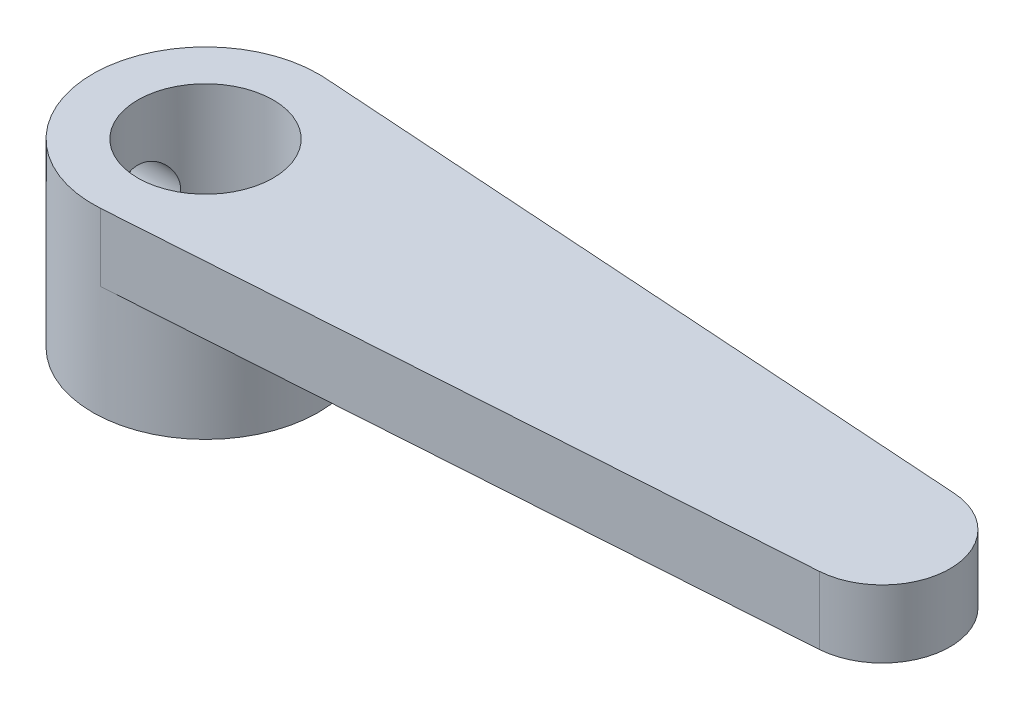
ISO-10303-21;
HEADER;
FILE_DESCRIPTION(('STEP AP214'),'2;1');
FILE_NAME('part.step','',(''),(''),'','','');
FILE_SCHEMA(('AUTOMOTIVE_DESIGN { 1 0 10303 214 1 1 1 1 }'));
ENDSEC;
DATA;
#1=APPLICATION_CONTEXT('core data for automotive mechanical design processes');
#2=APPLICATION_PROTOCOL_DEFINITION('international standard','automotive_design',2000,#1);
#3=PRODUCT_CONTEXT('',#1,'mechanical');
#4=PRODUCT('Part','Part','',(#3));
#5=PRODUCT_RELATED_PRODUCT_CATEGORY('part','',(#4));
#6=PRODUCT_DEFINITION_FORMATION('','',#4);
#7=PRODUCT_DEFINITION_CONTEXT('part definition',#1,'design');
#8=PRODUCT_DEFINITION('design','',#6,#7);
#9=PRODUCT_DEFINITION_SHAPE('','',#8);
#10=(LENGTH_UNIT() NAMED_UNIT(*) SI_UNIT(.MILLI.,.METRE.));
#11=(NAMED_UNIT(*) PLANE_ANGLE_UNIT() SI_UNIT($,.RADIAN.));
#12=(NAMED_UNIT(*) SI_UNIT($,.STERADIAN.) SOLID_ANGLE_UNIT());
#13=UNCERTAINTY_MEASURE_WITH_UNIT(LENGTH_MEASURE(1.E-05),#10,'distance_accuracy_value','');
#14=(GEOMETRIC_REPRESENTATION_CONTEXT(3) GLOBAL_UNCERTAINTY_ASSIGNED_CONTEXT((#13)) GLOBAL_UNIT_ASSIGNED_CONTEXT((#10,
#11,#12)) REPRESENTATION_CONTEXT('',''));
#15=CARTESIAN_POINT('',(0.,0.,0.));
#16=DIRECTION('',(0.,0.,1.));
#17=DIRECTION('',(1.,0.,0.));
#18=AXIS2_PLACEMENT_3D('',#15,#16,#17);
#19=CARTESIAN_POINT('',(0.,0.,0.));
#20=DIRECTION('',(0.,1.,0.));
#21=DIRECTION('',(0.,0.,1.));
#22=AXIS2_PLACEMENT_3D('',#19,#20,#21);
#23=PLANE('',#22);
#24=CARTESIAN_POINT('',(0.,0.,0.));
#25=DIRECTION('',(0.,-1.,0.));
#26=DIRECTION('',(0.,0.,-1.));
#27=AXIS2_PLACEMENT_3D('',#24,#25,#26);
#28=CIRCLE('',#27,5.);
#29=CARTESIAN_POINT('',(0.333333333333334,0.,-4.98887651569859));
#30=VERTEX_POINT('',#29);
#31=CARTESIAN_POINT('',(0.333333333333333,0.,4.98887651569859));
#32=VERTEX_POINT('',#31);
#33=EDGE_CURVE('E88',#30,#32,#28,.T.);
#34=ORIENTED_EDGE('',*,*,#33,.F.);
#35=DIRECTION('',(-0.997775303139718,0.,-0.0666666666666667));
#36=VECTOR('',#35,1.);
#37=CARTESIAN_POINT('',(0.333333333333333,0.,-4.98887651569859));
#38=LINE('',#37,#36);
#39=CARTESIAN_POINT('',(30.2,0.,-2.99332590941915));
#40=VERTEX_POINT('',#39);
#41=EDGE_CURVE('E90',#40,#30,#38,.T.);
#42=ORIENTED_EDGE('',*,*,#41,.F.);
#43=CARTESIAN_POINT('',(30.,0.,0.));
#44=DIRECTION('',(0.,1.,0.));
#45=DIRECTION('',(0.,0.,-1.));
#46=AXIS2_PLACEMENT_3D('',#43,#44,#45);
#47=CIRCLE('',#46,3.);
#48=CARTESIAN_POINT('',(30.2,0.,2.99332590941915));
#49=VERTEX_POINT('',#48);
#50=EDGE_CURVE('E78',#49,#40,#47,.T.);
#51=ORIENTED_EDGE('',*,*,#50,.F.);
#52=DIRECTION('',(0.997775303139718,0.,-0.0666666666666667));
#53=VECTOR('',#52,1.);
#54=CARTESIAN_POINT('',(0.333333333333333,0.,4.98887651569859));
#55=LINE('',#54,#53);
#56=EDGE_CURVE('E71',#32,#49,#55,.T.);
#57=ORIENTED_EDGE('',*,*,#56,.F.);
#58=EDGE_LOOP('',(#34,#42,#51,#57));
#59=FACE_BOUND('',#58,.T.);
#60=ADVANCED_FACE('F33',(#59),#23,.F.);
#61=CARTESIAN_POINT('',(0.,3.,0.));
#62=DIRECTION('',(0.,1.,0.));
#63=DIRECTION('',(0.,0.,1.));
#64=AXIS2_PLACEMENT_3D('',#61,#62,#63);
#65=PLANE('',#64);
#66=CARTESIAN_POINT('',(0.,3.,0.));
#67=DIRECTION('',(0.,1.,0.));
#68=DIRECTION('',(0.,0.,1.));
#69=AXIS2_PLACEMENT_3D('',#66,#67,#68);
#70=CIRCLE('',#69,5.);
#71=CARTESIAN_POINT('',(0.333333333333333,3.,-4.98887651569859));
#72=VERTEX_POINT('',#71);
#73=CARTESIAN_POINT('',(0.333333333333333,3.,4.98887651569859));
#74=VERTEX_POINT('',#73);
#75=EDGE_CURVE('E102',#72,#74,#70,.T.);
#76=ORIENTED_EDGE('',*,*,#75,.T.);
#77=DIRECTION('',(0.997775303139718,0.,-0.0666666666666667));
#78=VECTOR('',#77,1.);
#79=CARTESIAN_POINT('',(0.333333333333333,3.,4.98887651569859));
#80=LINE('',#79,#78);
#81=CARTESIAN_POINT('',(30.2,3.,2.99332590941915));
#82=VERTEX_POINT('',#81);
#83=EDGE_CURVE('E83',#74,#82,#80,.T.);
#84=ORIENTED_EDGE('',*,*,#83,.T.);
#85=CARTESIAN_POINT('',(30.,3.,0.));
#86=DIRECTION('',(0.,1.,0.));
#87=DIRECTION('',(0.,0.,-1.));
#88=AXIS2_PLACEMENT_3D('',#85,#86,#87);
#89=CIRCLE('',#88,3.);
#90=CARTESIAN_POINT('',(30.2,3.,-2.99332590941915));
#91=VERTEX_POINT('',#90);
#92=EDGE_CURVE('E107',#82,#91,#89,.T.);
#93=ORIENTED_EDGE('',*,*,#92,.T.);
#94=DIRECTION('',(-0.997775303139718,0.,-0.0666666666666667));
#95=VECTOR('',#94,1.);
#96=CARTESIAN_POINT('',(0.333333333333333,3.,-4.98887651569859));
#97=LINE('',#96,#95);
#98=EDGE_CURVE('E57',#91,#72,#97,.T.);
#99=ORIENTED_EDGE('',*,*,#98,.T.);
#100=EDGE_LOOP('',(#76,#84,#93,#99));
#101=FACE_BOUND('',#100,.T.);
#102=CARTESIAN_POINT('',(0.,3.,0.));
#103=DIRECTION('',(0.,1.,0.));
#104=DIRECTION('',(0.,0.,1.));
#105=AXIS2_PLACEMENT_3D('',#102,#103,#104);
#106=CIRCLE('',#105,3.);
#107=CARTESIAN_POINT('',(0.,3.,3.));
#108=VERTEX_POINT('',#107);
#109=EDGE_CURVE('E113',#108,#108,#106,.T.);
#110=ORIENTED_EDGE('',*,*,#109,.F.);
#111=EDGE_LOOP('',(#110));
#112=FACE_BOUND('',#111,.T.);
#113=ADVANCED_FACE('F144',(#101,#112),#65,.T.);
#114=CARTESIAN_POINT('',(0.,3.,0.));
#115=DIRECTION('',(0.,-1.,0.));
#116=DIRECTION('',(0.,0.,-1.));
#117=AXIS2_PLACEMENT_3D('',#114,#115,#116);
#118=CYLINDRICAL_SURFACE('',#117,5.);
#119=CARTESIAN_POINT('',(-5.,-2.5,0.));
#120=CARTESIAN_POINT('',(-4.9999992925055,-2.49999900251511,-0.0822886127533));
#121=CARTESIAN_POINT('',(-4.99794915693954,-2.49320613637603,-0.164587318351529));
#122=CARTESIAN_POINT('',(-4.98997105593691,-2.4662786457779,-0.326788125304881));
#123=CARTESIAN_POINT('',(-4.98404193389692,-2.44614004197666,-0.40668950441142));
#124=CARTESIAN_POINT('',(-4.96895552501837,-2.39325398308974,-0.561732707754527));
#125=CARTESIAN_POINT('',(-4.95980300250426,-2.36052513038106,-0.636881364395373));
#126=CARTESIAN_POINT('',(-4.93922109237646,-2.28346390694416,-0.780624181053131));
#127=CARTESIAN_POINT('',(-4.92779140192067,-2.23912999260458,-0.84921746746967));
#128=CARTESIAN_POINT('',(-4.90350737192774,-2.13877599252733,-0.979871797183745));
#129=CARTESIAN_POINT('',(-4.89062383657036,-2.08248337411409,-1.04171807124434));
#130=CARTESIAN_POINT('',(-4.86505834210442,-1.96039077008982,-1.15524920923324));
#131=CARTESIAN_POINT('',(-4.85237641724502,-1.89458918787504,-1.20693236327441));
#132=CARTESIAN_POINT('',(-4.82834113993772,-1.75352924696239,-1.29980037723708));
#133=CARTESIAN_POINT('',(-4.81702406663875,-1.67809153900926,-1.34072309022213));
#134=CARTESIAN_POINT('',(-4.79743620394031,-1.52101074576971,-1.4092139477476));
#135=CARTESIAN_POINT('',(-4.78916468313311,-1.43936915607202,-1.43678529919973));
#136=CARTESIAN_POINT('',(-4.77690870838434,-1.27460973386954,-1.47701633682652));
#137=CARTESIAN_POINT('',(-4.77281069324534,-1.19159725613606,-1.49007196234677));
#138=CARTESIAN_POINT('',(-4.76902789749768,-1.02446684378323,-1.50213730614672));
#139=CARTESIAN_POINT('',(-4.76934204760571,-0.940349181940912,-1.50115042761078));
#140=CARTESIAN_POINT('',(-4.77424744067778,-0.776616091391516,-1.48546977199812));
#141=CARTESIAN_POINT('',(-4.77868388599141,-0.696947749637761,-1.47127205262685));
#142=CARTESIAN_POINT('',(-4.79108356228624,-0.541180213726539,-1.43037420427056));
#143=CARTESIAN_POINT('',(-4.79904714132351,-0.465081372625666,-1.40367284141641));
#144=CARTESIAN_POINT('',(-4.81772733074973,-0.31739965033926,-1.33816026653682));
#145=CARTESIAN_POINT('',(-4.82848016115952,-0.245892916044737,-1.29918816934642));
#146=CARTESIAN_POINT('',(-4.85150987000065,-0.110267977989807,-1.21035222588683));
#147=CARTESIAN_POINT('',(-4.86378711746991,-0.0461515705862217,-1.16048574002588));
#148=CARTESIAN_POINT('',(-4.88911011297938,0.0756861907620217,-1.04881290765546));
#149=CARTESIAN_POINT('',(-4.90216654310498,0.133028664029671,-0.986594907466971));
#150=CARTESIAN_POINT('',(-4.92712244063259,0.236553984064249,-0.853263259313966));
#151=CARTESIAN_POINT('',(-4.9390218351841,0.282736128414427,-0.782149051860887));
#152=CARTESIAN_POINT('',(-4.96043160069471,0.362859922464731,-0.632355038342802));
#153=CARTESIAN_POINT('',(-4.96992543668314,0.396717516249861,-0.55362774974795));
#154=CARTESIAN_POINT('',(-4.98533521832222,0.450599590099631,-0.391245415603519));
#155=CARTESIAN_POINT('',(-4.99125216187,0.47062792853249,-0.307591751589581));
#156=CARTESIAN_POINT('',(-4.99868364643539,0.495652177899394,-0.140952242668331));
#157=CARTESIAN_POINT('',(-5.0003485041779,0.501161585801611,-0.0580500976011861));
#158=CARTESIAN_POINT('',(-4.9995292324176,0.498430844287919,0.107499605823384));
#159=CARTESIAN_POINT('',(-4.99704565677757,0.490192530348558,0.190147196690782));
#160=CARTESIAN_POINT('',(-4.98830696987163,0.460615388888504,0.350903605309698));
#161=CARTESIAN_POINT('',(-4.98213829799417,0.43957661241913,0.42907277261417));
#162=CARTESIAN_POINT('',(-4.96674347841533,0.385356767221799,0.580754638954522));
#163=CARTESIAN_POINT('',(-4.95751696321085,0.352174238962138,0.654266777025584));
#164=CARTESIAN_POINT('',(-4.93669654351325,0.273746834518868,0.796437189461053));
#165=CARTESIAN_POINT('',(-4.92505280829675,0.228240659052027,0.86494382619967));
#166=CARTESIAN_POINT('',(-4.90073468764318,0.126775245947188,0.993523307980147));
#167=CARTESIAN_POINT('',(-4.8880600443108,0.0708133881123275,1.05359403235594));
#168=CARTESIAN_POINT('',(-4.86253171869138,-0.0523873083693465,1.16585744551027));
#169=CARTESIAN_POINT('',(-4.84968825033268,-0.119961875771737,1.21768481231504));
#170=CARTESIAN_POINT('',(-4.82576515238464,-0.263127939013533,1.30928995072154));
#171=CARTESIAN_POINT('',(-4.81468547654652,-0.338719224558215,1.34906803829472));
#172=CARTESIAN_POINT('',(-4.79567189615055,-0.495532491254689,1.41517347127168));
#173=CARTESIAN_POINT('',(-4.78772337843827,-0.576726186536592,1.4415634693705));
#174=CARTESIAN_POINT('',(-4.77591594362794,-0.742687968931479,1.48021730815114));
#175=CARTESIAN_POINT('',(-4.77205562508301,-0.82745482078767,1.49248598978779));
#176=CARTESIAN_POINT('',(-4.76899972496087,-0.994361518376229,1.50221984485059));
#177=CARTESIAN_POINT('',(-4.76961647442755,-1.07646365101759,1.5002805530849));
#178=CARTESIAN_POINT('',(-4.77499401288294,-1.2391141033728,1.48307505444813));
#179=CARTESIAN_POINT('',(-4.77975463592551,-1.31966248517635,1.46780938124716));
#180=CARTESIAN_POINT('',(-4.79275763670386,-1.47594539914285,1.42476888804136));
#181=CARTESIAN_POINT('',(-4.80095604545965,-1.55172728736169,1.39715175507068));
#182=CARTESIAN_POINT('',(-4.81990278909137,-1.69764243881772,1.33031507121129));
#183=CARTESIAN_POINT('',(-4.83065161194312,-1.76777461764076,1.29109329962876));
#184=CARTESIAN_POINT('',(-4.85397676425833,-1.90316311652711,1.20048763805072));
#185=CARTESIAN_POINT('',(-4.86660540163798,-1.96814876126041,1.14871276092994));
#186=CARTESIAN_POINT('',(-4.89201320450026,-2.08870249830786,1.03517434629782));
#187=CARTESIAN_POINT('',(-4.90479240823905,-2.14426813946776,0.973408217134501));
#188=CARTESIAN_POINT('',(-4.92950936570649,-2.24602341229503,0.839465762183247));
#189=CARTESIAN_POINT('',(-4.94141159765674,-2.29189144685549,0.767037885790607));
#190=CARTESIAN_POINT('',(-4.96260680455813,-2.37073516990403,0.615141373983529));
#191=CARTESIAN_POINT('',(-4.97190099931067,-2.40371688827451,0.535676052998954));
#192=CARTESIAN_POINT('',(-4.98602174969301,-2.45289527565275,0.380757712655281));
#193=CARTESIAN_POINT('',(-4.99122027381068,-2.47051167288325,0.305786961954234));
#194=CARTESIAN_POINT('',(-4.99820944494493,-2.49406352524158,0.15388019523078));
#195=CARTESIAN_POINT('',(-5.0000006615474,-2.50000093270482,0.0769445098581396));
#196=CARTESIAN_POINT('',(-5.,-2.5,0.));
#197=B_SPLINE_CURVE_WITH_KNOTS('',3,(#119,#120,#121,#122,#123,#124,#125,#126,#127,#128,#129,
#130,#131,#132,#133,#134,#135,#136,#137,#138,#139,#140,#141,#142,#143,#144,#145,#146,#147,#148,
#149,#150,#151,#152,#153,#154,#155,#156,#157,#158,#159,#160,#161,#162,#163,#164,#165,#166,#167,
#168,#169,#170,#171,#172,#173,#174,#175,#176,#177,#178,#179,#180,#181,#182,#183,#184,#185,#186,
#187,#188,#189,#190,#191,#192,#193,#194,#195,#196),.UNSPECIFIED.,.T.,.F.,(4,2,2,2,2,2,2,2,2,2,2,
2,2,2,2,2,2,2,2,2,2,2,2,2,2,2,2,2,2,2,2,2,2,2,2,2,2,2,4),(0.,0.246583203612611,0.493239964846,
0.739533676300875,0.985860164412702,1.23855602948191,1.49129437288633,1.74971481004109,
2.00807314543224,2.25919689356599,2.51025978319089,2.75226016697676,2.99428443658001,
3.2396242644712,3.48502360158555,3.74067104048167,3.99633456531071,4.25371046881689,
4.51101453528808,4.75908809438545,5.00712853550327,5.24956746682327,5.49203554593729,
5.74011305702908,5.98825282000191,6.24540400322818,6.5025484425268,6.75847814951252,
7.01432009460283,7.25950155466943,7.504673196616,7.74680040402721,7.98897397553107,
8.23996925679931,8.49102974897502,8.74942996156671,9.00770911595235,9.23831691930459,
9.46888616948874),.UNSPECIFIED.);
#198=CARTESIAN_POINT('',(-5.,-2.5,0.));
#199=VERTEX_POINT('',#198);
#200=EDGE_CURVE('E125',#199,#199,#197,.T.);
#201=ORIENTED_EDGE('',*,*,#200,.T.);
#202=EDGE_LOOP('',(#201));
#203=FACE_BOUND('',#202,.T.);
#204=DIRECTION('',(0.,-1.,0.));
#205=VECTOR('',#204,1.);
#206=CARTESIAN_POINT('',(0.333333333333333,3.,-4.98887651569859));
#207=LINE('',#206,#205);
#208=EDGE_CURVE('E99',#72,#30,#207,.T.);
#209=ORIENTED_EDGE('',*,*,#208,.T.);
#210=ORIENTED_EDGE('',*,*,#33,.T.);
#211=DIRECTION('',(0.,-1.,0.));
#212=VECTOR('',#211,1.);
#213=CARTESIAN_POINT('',(0.333333333333333,3.,4.98887651569859));
#214=LINE('',#213,#212);
#215=EDGE_CURVE('E11',#74,#32,#214,.T.);
#216=ORIENTED_EDGE('',*,*,#215,.F.);
#217=ORIENTED_EDGE('',*,*,#75,.F.);
#218=EDGE_LOOP('',(#209,#210,#216,#217));
#219=FACE_BOUND('',#218,.T.);
#220=CARTESIAN_POINT('',(0.,-5.,0.));
#221=DIRECTION('',(0.,-1.,0.));
#222=DIRECTION('',(0.,0.,-1.));
#223=AXIS2_PLACEMENT_3D('',#220,#221,#222);
#224=CIRCLE('',#223,5.);
#225=CARTESIAN_POINT('',(0.,-5.,-5.));
#226=VERTEX_POINT('',#225);
#227=EDGE_CURVE('E94',#226,#226,#224,.T.);
#228=ORIENTED_EDGE('',*,*,#227,.F.);
#229=EDGE_LOOP('',(#228));
#230=FACE_BOUND('',#229,.T.);
#231=ADVANCED_FACE('F35',(#203,#219,#230),#118,.T.);
#232=CARTESIAN_POINT('',(0.333333333333333,3.,4.98887651569859));
#233=DIRECTION('',(-0.0666666666666667,0.,-0.997775303139718));
#234=DIRECTION('',(-0.997775303139718,0.,0.0666666666666667));
#235=AXIS2_PLACEMENT_3D('',#232,#233,#234);
#236=PLANE('',#235);
#237=ORIENTED_EDGE('',*,*,#56,.T.);
#238=DIRECTION('',(0.,-1.,0.));
#239=VECTOR('',#238,1.);
#240=CARTESIAN_POINT('',(30.2,3.,2.99332590941915));
#241=LINE('',#240,#239);
#242=EDGE_CURVE('E49',#82,#49,#241,.T.);
#243=ORIENTED_EDGE('',*,*,#242,.F.);
#244=ORIENTED_EDGE('',*,*,#83,.F.);
#245=ORIENTED_EDGE('',*,*,#215,.T.);
#246=EDGE_LOOP('',(#237,#243,#244,#245));
#247=FACE_BOUND('',#246,.T.);
#248=ADVANCED_FACE('F152',(#247),#236,.F.);
#249=CARTESIAN_POINT('',(30.,3.,0.));
#250=DIRECTION('',(0.,-1.,0.));
#251=DIRECTION('',(0.,0.,-1.));
#252=AXIS2_PLACEMENT_3D('',#249,#250,#251);
#253=CYLINDRICAL_SURFACE('',#252,3.);
#254=ORIENTED_EDGE('',*,*,#50,.T.);
#255=DIRECTION('',(0.,-1.,0.));
#256=VECTOR('',#255,1.);
#257=CARTESIAN_POINT('',(30.2,3.,-2.99332590941915));
#258=LINE('',#257,#256);
#259=EDGE_CURVE('E101',#91,#40,#258,.T.);
#260=ORIENTED_EDGE('',*,*,#259,.F.);
#261=ORIENTED_EDGE('',*,*,#92,.F.);
#262=ORIENTED_EDGE('',*,*,#242,.T.);
#263=EDGE_LOOP('',(#254,#260,#261,#262));
#264=FACE_BOUND('',#263,.T.);
#265=ADVANCED_FACE('F112',(#264),#253,.T.);
#266=CARTESIAN_POINT('',(0.333333333333333,3.,-4.98887651569859));
#267=DIRECTION('',(-0.0666666666666667,0.,0.997775303139718));
#268=DIRECTION('',(0.997775303139718,0.,0.0666666666666667));
#269=AXIS2_PLACEMENT_3D('',#266,#267,#268);
#270=PLANE('',#269);
#271=ORIENTED_EDGE('',*,*,#41,.T.);
#272=ORIENTED_EDGE('',*,*,#208,.F.);
#273=ORIENTED_EDGE('',*,*,#98,.F.);
#274=ORIENTED_EDGE('',*,*,#259,.T.);
#275=EDGE_LOOP('',(#271,#272,#273,#274));
#276=FACE_BOUND('',#275,.T.);
#277=ADVANCED_FACE('F98',(#276),#270,.F.);
#278=CARTESIAN_POINT('',(0.,3.,0.));
#279=DIRECTION('',(0.,-1.,0.));
#280=DIRECTION('',(0.,0.,-1.));
#281=AXIS2_PLACEMENT_3D('',#278,#279,#280);
#282=CYLINDRICAL_SURFACE('',#281,3.);
#283=CARTESIAN_POINT('',(-2.59807621135332,-1.,-1.5));
#284=CARTESIAN_POINT('',(-2.59808302092689,-0.921838287707125,-1.4999945446118));
#285=CARTESIAN_POINT('',(-2.60165701781635,-0.843577882712432,-1.49384995609983));
#286=CARTESIAN_POINT('',(-2.61543549678079,-0.689459102984271,-1.46958481484708));
#287=CARTESIAN_POINT('',(-2.62565391083339,-0.613606127434888,-1.45143909683127));
#288=CARTESIAN_POINT('',(-2.65124019908098,-0.466822503484089,-1.40414992304972));
#289=CARTESIAN_POINT('',(-2.66658065209878,-0.39586802128962,-1.3750649287406));
#290=CARTESIAN_POINT('',(-2.70063997225287,-0.259863697004921,-1.30690128806456));
#291=CARTESIAN_POINT('',(-2.71935902214097,-0.194814174606314,-1.26782210105366));
#292=CARTESIAN_POINT('',(-2.75995303586162,-0.0665414071637416,-1.17699981079632));
#293=CARTESIAN_POINT('',(-2.7819609545693,-0.00391129648968492,-1.12447805421566));
#294=CARTESIAN_POINT('',(-2.82557974178559,0.112112582610064,-1.0098807114217));
#295=CARTESIAN_POINT('',(-2.84719040746875,0.165501743875281,-0.94780038867344));
#296=CARTESIAN_POINT('',(-2.88932215429424,0.265050726721494,-0.810734345121819));
#297=CARTESIAN_POINT('',(-2.90967159627259,0.310480651789295,-0.735160783518862));
#298=CARTESIAN_POINT('',(-2.94526134149294,0.387711279868644,-0.576235539899256));
#299=CARTESIAN_POINT('',(-2.96050486775612,0.419520584205755,-0.492888807207233));
#300=CARTESIAN_POINT('',(-2.98320691866356,0.466256991951646,-0.327067415888966));
#301=CARTESIAN_POINT('',(-2.99114220331338,0.4822242895333,-0.244952685733226));
#302=CARTESIAN_POINT('',(-3.00011375769101,0.500249178012557,-0.0788559430467722));
#303=CARTESIAN_POINT('',(-3.00115420176885,0.502315185193565,0.00512490876560766));
#304=CARTESIAN_POINT('',(-2.99644472874675,0.492879989044476,0.164748786635625));
#305=CARTESIAN_POINT('',(-2.99127743838241,0.482542976718166,0.240481798765187));
#306=CARTESIAN_POINT('',(-2.97561367889621,0.450678734143014,0.388970657877483));
#307=CARTESIAN_POINT('',(-2.96511681099591,0.429150666535666,0.461726281640888));
#308=CARTESIAN_POINT('',(-2.93957374931482,0.37537615086528,0.60346408735433));
#309=CARTESIAN_POINT('',(-2.92446662293799,0.342985530241899,0.672380135272768));
#310=CARTESIAN_POINT('',(-2.89106468980031,0.26860487569776,0.803965202269993));
#311=CARTESIAN_POINT('',(-2.87276874236226,0.226611405046475,0.866631973257969));
#312=CARTESIAN_POINT('',(-2.83266591598844,0.129656972700477,0.990260491347292));
#313=CARTESIAN_POINT('',(-2.81069063997263,0.0738454575109849,1.05050111254404));
#314=CARTESIAN_POINT('',(-2.76681510880218,-0.046884587395265,1.16115655544667));
#315=CARTESIAN_POINT('',(-2.74491492398443,-0.111810058411094,1.21156381736135));
#316=CARTESIAN_POINT('',(-2.70216234138727,-0.253972288636131,1.30425800196332));
#317=CARTESIAN_POINT('',(-2.68146479986061,-0.331729034581317,1.34582597246708));
#318=CARTESIAN_POINT('',(-2.64563175417864,-0.494406507038497,1.41497866950185));
#319=CARTESIAN_POINT('',(-2.63049045069101,-0.579319649526343,1.44257798731633));
#320=CARTESIAN_POINT('',(-2.60916953725552,-0.746821766924186,1.48077031653756));
#321=CARTESIAN_POINT('',(-2.60237483772745,-0.829061678565328,1.49253768317996));
#322=CARTESIAN_POINT('',(-2.59676879042414,-0.994602012274813,1.50227541991714));
#323=CARTESIAN_POINT('',(-2.59795180333967,-1.07790164367968,1.50025553597254));
#324=CARTESIAN_POINT('',(-2.60751504810877,-1.23348087786809,1.48355406501595));
#325=CARTESIAN_POINT('',(-2.61509381259981,-1.30596917666189,1.4702817250687));
#326=CARTESIAN_POINT('',(-2.63541032327012,-1.44755167940644,1.43354442694866));
#327=CARTESIAN_POINT('',(-2.64814974007551,-1.51664477611991,1.41007616793542));
#328=CARTESIAN_POINT('',(-2.67804333119485,-1.65311699635404,1.35247138290733));
#329=CARTESIAN_POINT('',(-2.69537464864595,-1.72026852528033,1.31789109553909));
#330=CARTESIAN_POINT('',(-2.73234179245875,-1.84820390730849,1.23943059602371));
#331=CARTESIAN_POINT('',(-2.75197880032721,-1.90898446526993,1.19554560649832));
#332=CARTESIAN_POINT('',(-2.79431997684504,-2.03046815128532,1.09325575079828));
#333=CARTESIAN_POINT('',(-2.81709874731434,-2.09019572607649,1.03371790847245));
#334=CARTESIAN_POINT('',(-2.86101352466839,-2.19911835699039,0.905106743097433));
#335=CARTESIAN_POINT('',(-2.88214897511564,-2.24830985534581,0.83603021198302));
#336=CARTESIAN_POINT('',(-2.92112042536435,-2.33586058892515,0.687803043838136));
#337=CARTESIAN_POINT('',(-2.93885462508044,-2.37389967731637,0.60843464636117));
#338=CARTESIAN_POINT('',(-2.96825032438952,-2.43570685578609,0.443283546961623));
#339=CARTESIAN_POINT('',(-2.9799171551456,-2.45948747704946,0.357506552088264));
#340=CARTESIAN_POINT('',(-2.99501262272824,-2.49005284626199,0.190469523495626));
#341=CARTESIAN_POINT('',(-2.99909891862287,-2.49819681381417,0.109517165775685));
#342=CARTESIAN_POINT('',(-3.00063195562697,-2.5012648981816,-0.0526889789268056));
#343=CARTESIAN_POINT('',(-2.99808102100335,-2.49619364278535,-0.13394265044263));
#344=CARTESIAN_POINT('',(-2.98700953256884,-2.47387538980656,-0.288806988475721));
#345=CARTESIAN_POINT('',(-2.97889342001985,-2.45745272611349,-0.362568476716896));
#346=CARTESIAN_POINT('',(-2.95788140495135,-2.41400950104554,-0.506168928275427));
#347=CARTESIAN_POINT('',(-2.94498481699194,-2.38698741985982,-0.576007327433263));
#348=CARTESIAN_POINT('',(-2.9148889612218,-2.32190942175104,-0.713135109367327));
#349=CARTESIAN_POINT('',(-2.89752925798199,-2.28343101518824,-0.78018771405007));
#350=CARTESIAN_POINT('',(-2.86032199712739,-2.19706310371142,-0.907161962721038));
#351=CARTESIAN_POINT('',(-2.84047329837541,-2.14916927632649,-0.967080311122361));
#352=CARTESIAN_POINT('',(-2.79792915339941,-2.03980429146595,-1.08437100623534));
#353=CARTESIAN_POINT('',(-2.77514698517547,-1.97745626878421,-1.14089652680891));
#354=CARTESIAN_POINT('',(-2.73094614244278,-1.84382391830535,-1.24299493109201));
#355=CARTESIAN_POINT('',(-2.70952868642798,-1.77253176869847,-1.28855812501509));
#356=CARTESIAN_POINT('',(-2.66999407957374,-1.62004503012857,-1.36864661967848));
#357=CARTESIAN_POINT('',(-2.65200261384405,-1.5386087033069,-1.40277759894141));
#358=CARTESIAN_POINT('',(-2.62299234492527,-1.37000139349033,-1.45631806425962));
#359=CARTESIAN_POINT('',(-2.61195024221553,-1.28285066663097,-1.47577678676302));
#360=CARTESIAN_POINT('',(-2.60293908902686,-1.16229196652201,-1.49155051179662));
#361=CARTESIAN_POINT('',(-2.60112193507728,-1.12994815840318,-1.49471415744578));
#362=CARTESIAN_POINT('',(-2.59868903831625,-1.06507527897664,-1.49894010763494));
#363=CARTESIAN_POINT('',(-2.59807337587664,-1.03254619542119,-1.50000227159981));
#364=CARTESIAN_POINT('',(-2.59807621135332,-1.,-1.5));
#365=B_SPLINE_CURVE_WITH_KNOTS('',3,(#283,#284,#285,#286,#287,#288,#289,#290,#291,#292,#293,
#294,#295,#296,#297,#298,#299,#300,#301,#302,#303,#304,#305,#306,#307,#308,#309,#310,#311,#312,
#313,#314,#315,#316,#317,#318,#319,#320,#321,#322,#323,#324,#325,#326,#327,#328,#329,#330,#331,
#332,#333,#334,#335,#336,#337,#338,#339,#340,#341,#342,#343,#344,#345,#346,#347,#348,#349,#350,
#351,#352,#353,#354,#355,#356,#357,#358,#359,#360,#361,#362,#363,#364),.UNSPECIFIED.,.T.,.F.,(4,
2,2,2,2,2,2,2,2,2,2,2,2,2,2,2,2,2,2,2,2,2,2,2,2,2,2,2,2,2,2,2,2,2,2,2,2,2,2,2,4),(0.,
0.234348183892073,0.469189339237207,0.702792893878329,0.936409088167724,1.18929346874735,
1.44230356626556,1.71236838358145,1.98226240445837,2.23295227451903,2.4834903552906,
2.71224146226808,2.94100968776183,3.1729430209672,3.40495949025408,3.65890787185336,
3.91305072368878,4.18333262594173,4.45333161317557,4.70193436281318,4.9503613978256,
5.17161275136038,5.39293578654095,5.62450944609132,5.85620229330071,6.1171011537092,
6.37808797467303,6.64596272119449,6.91360169713157,7.1566840558423,7.39968130190958,
7.62666637307239,7.8536840026802,8.09041126079208,8.32724745151079,8.58765362775101,
8.84828914267732,9.11716123557908,9.38512699504141,9.48270202777964,9.58028358741811),.UNSPECIFIED.);
#366=CARTESIAN_POINT('',(-2.59807621135332,-1.,-1.5));
#367=VERTEX_POINT('',#366);
#368=EDGE_CURVE('E38',#367,#367,#365,.T.);
#369=ORIENTED_EDGE('',*,*,#368,.F.);
#370=EDGE_LOOP('',(#369));
#371=FACE_BOUND('',#370,.T.);
#372=ORIENTED_EDGE('',*,*,#109,.T.);
#373=EDGE_LOOP('',(#372));
#374=FACE_BOUND('',#373,.T.);
#375=CARTESIAN_POINT('',(0.,-5.,0.));
#376=DIRECTION('',(0.,-1.,0.));
#377=DIRECTION('',(0.,0.,-1.));
#378=AXIS2_PLACEMENT_3D('',#375,#376,#377);
#379=CIRCLE('',#378,3.);
#380=CARTESIAN_POINT('',(0.,-5.,-3.));
#381=VERTEX_POINT('',#380);
#382=EDGE_CURVE('E95',#381,#381,#379,.T.);
#383=ORIENTED_EDGE('',*,*,#382,.T.);
#384=EDGE_LOOP('',(#383));
#385=FACE_BOUND('',#384,.T.);
#386=ADVANCED_FACE('F138',(#371,#374,#385),#282,.F.);
#387=CARTESIAN_POINT('',(0.,-5.,0.));
#388=DIRECTION('',(0.,-1.,0.));
#389=DIRECTION('',(0.,0.,-1.));
#390=AXIS2_PLACEMENT_3D('',#387,#388,#389);
#391=PLANE('',#390);
#392=ORIENTED_EDGE('',*,*,#227,.T.);
#393=EDGE_LOOP('',(#392));
#394=FACE_BOUND('',#393,.T.);
#395=ORIENTED_EDGE('',*,*,#382,.F.);
#396=EDGE_LOOP('',(#395));
#397=FACE_BOUND('',#396,.T.);
#398=ADVANCED_FACE('F134',(#394,#397),#391,.T.);
#399=CARTESIAN_POINT('',(-5.,-1.,0.));
#400=DIRECTION('',(1.,0.,0.));
#401=DIRECTION('',(0.,0.,-1.));
#402=AXIS2_PLACEMENT_3D('',#399,#400,#401);
#403=CYLINDRICAL_SURFACE('',#402,1.5);
#404=ORIENTED_EDGE('',*,*,#368,.T.);
#405=EDGE_LOOP('',(#404));
#406=FACE_BOUND('',#405,.T.);
#407=ORIENTED_EDGE('',*,*,#200,.F.);
#408=EDGE_LOOP('',(#407));
#409=FACE_BOUND('',#408,.T.);
#410=ADVANCED_FACE('F130',(#406,#409),#403,.F.);
#411=CLOSED_SHELL('',(#60,#113,#231,#248,#265,#277,#386,#398,#410));
#412=MANIFOLD_SOLID_BREP('B2',#411);
#413=ADVANCED_BREP_SHAPE_REPRESENTATION('',(#18,#412),#14);
#414=SHAPE_DEFINITION_REPRESENTATION(#9,#413);
ENDSEC;
END-ISO-10303-21;
